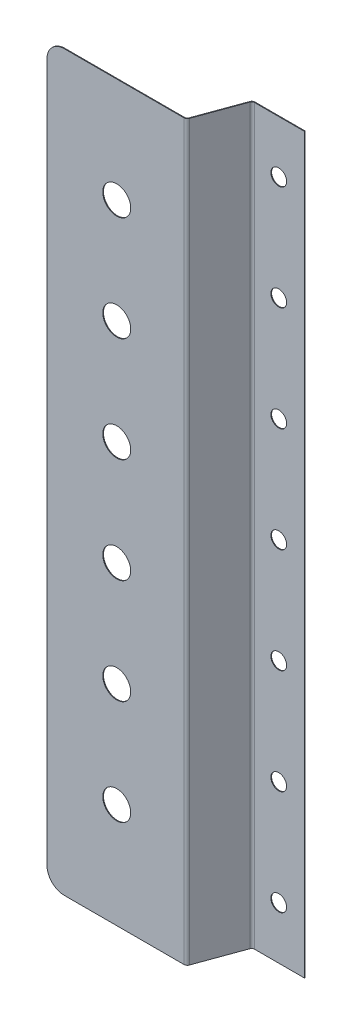
ISO-10303-21;
HEADER;
FILE_DESCRIPTION(('STEP AP214'),'2;1');
FILE_NAME('part.step','',(''),(''),'','','');
FILE_SCHEMA(('AUTOMOTIVE_DESIGN { 1 0 10303 214 1 1 1 1 }'));
ENDSEC;
DATA;
#1=APPLICATION_CONTEXT('core data for automotive mechanical design processes');
#2=APPLICATION_PROTOCOL_DEFINITION('international standard','automotive_design',2000,#1);
#3=PRODUCT_CONTEXT('',#1,'mechanical');
#4=PRODUCT('Part','Part','',(#3));
#5=PRODUCT_RELATED_PRODUCT_CATEGORY('part','',(#4));
#6=PRODUCT_DEFINITION_FORMATION('','',#4);
#7=PRODUCT_DEFINITION_CONTEXT('part definition',#1,'design');
#8=PRODUCT_DEFINITION('design','',#6,#7);
#9=PRODUCT_DEFINITION_SHAPE('','',#8);
#10=(LENGTH_UNIT() NAMED_UNIT(*) SI_UNIT(.MILLI.,.METRE.));
#11=(NAMED_UNIT(*) PLANE_ANGLE_UNIT() SI_UNIT($,.RADIAN.));
#12=(NAMED_UNIT(*) SI_UNIT($,.STERADIAN.) SOLID_ANGLE_UNIT());
#13=UNCERTAINTY_MEASURE_WITH_UNIT(LENGTH_MEASURE(1.E-05),#10,'distance_accuracy_value','');
#14=(GEOMETRIC_REPRESENTATION_CONTEXT(3) GLOBAL_UNCERTAINTY_ASSIGNED_CONTEXT((#13)) GLOBAL_UNIT_ASSIGNED_CONTEXT((#10,
#11,#12)) REPRESENTATION_CONTEXT('',''));
#15=CARTESIAN_POINT('',(0.,0.,0.));
#16=DIRECTION('',(0.,0.,1.));
#17=DIRECTION('',(1.,0.,0.));
#18=AXIS2_PLACEMENT_3D('',#15,#16,#17);
#19=CARTESIAN_POINT('',(45.0575081030319,0.,-14.0953893117886));
#20=DIRECTION('',(0.,1.,0.));
#21=DIRECTION('',(0.,0.,1.));
#22=AXIS2_PLACEMENT_3D('',#19,#20,#21);
#23=PLANE('',#22);
#24=DIRECTION('',(-0.939692620785907,0.,-0.342020143325671));
#25=VECTOR('',#24,1.);
#26=CARTESIAN_POINT('',(44.808309344353,0.,-13.4107213493623));
#27=LINE('',#26,#25);
#28=CARTESIAN_POINT('',(44.808309344353,0.,-13.4107213493623));
#29=VERTEX_POINT('',#28);
#30=CARTESIAN_POINT('',(44.6203708201958,0.,-13.4791253780274));
#31=VERTEX_POINT('',#30);
#32=EDGE_CURVE('E243',#29,#31,#27,.T.);
#33=ORIENTED_EDGE('',*,*,#32,.F.);
#34=DIRECTION('',(0.342020143325673,0.,-0.939692620785907));
#35=VECTOR('',#34,1.);
#36=CARTESIAN_POINT('',(35.2317130710728,0.,12.9007606667079));
#37=LINE('',#36,#35);
#38=CARTESIAN_POINT('',(40.1515076814876,0.,-0.616263933761181));
#39=VERTEX_POINT('',#38);
#40=EDGE_CURVE('E252',#39,#29,#37,.T.);
#41=ORIENTED_EDGE('',*,*,#40,.F.);
#42=DIRECTION('',(-0.939692620785907,0.,-0.342020143325673));
#43=VECTOR('',#42,1.);
#44=CARTESIAN_POINT('',(39.9635691573305,0.,-0.684667962426318));
#45=LINE('',#44,#43);
#46=CARTESIAN_POINT('',(39.9635691573305,0.,-0.684667962426315));
#47=VERTEX_POINT('',#46);
#48=EDGE_CURVE('E263',#47,#39,#45,.F.);
#49=ORIENTED_EDGE('',*,*,#48,.F.);
#50=DIRECTION('',(-0.342020143325673,0.,0.939692620785907));
#51=VECTOR('',#50,1.);
#52=CARTESIAN_POINT('',(44.8695695788747,0.,-14.1637933404537));
#53=LINE('',#52,#51);
#54=EDGE_CURVE('E257',#47,#31,#53,.F.);
#55=ORIENTED_EDGE('',*,*,#54,.T.);
#56=EDGE_LOOP('',(#33,#41,#49,#55));
#57=FACE_BOUND('',#56,.T.);
#58=ADVANCED_FACE('F78',(#57),#23,.F.);
#59=CARTESIAN_POINT('',(39.975102969662,210.,-0.131595971334866));
#60=DIRECTION('',(0.,-1.,0.));
#61=DIRECTION('',(0.,0.,-1.));
#62=AXIS2_PLACEMENT_3D('',#59,#60,#61);
#63=PLANE('',#62);
#64=DIRECTION('',(-0.939692620785907,0.,-0.342020143325671));
#65=VECTOR('',#64,1.);
#66=CARTESIAN_POINT('',(44.808309344353,210.,-13.4107213493623));
#67=LINE('',#66,#65);
#68=CARTESIAN_POINT('',(44.808309344353,210.,-13.4107213493623));
#69=VERTEX_POINT('',#68);
#70=CARTESIAN_POINT('',(44.6203708201958,210.,-13.4791253780274));
#71=VERTEX_POINT('',#70);
#72=EDGE_CURVE('E232',#69,#71,#67,.T.);
#73=ORIENTED_EDGE('',*,*,#72,.T.);
#74=DIRECTION('',(0.342020143325673,0.,-0.939692620785907));
#75=VECTOR('',#74,1.);
#76=CARTESIAN_POINT('',(39.7871644455048,210.,-0.199999999999997));
#77=LINE('',#76,#75);
#78=CARTESIAN_POINT('',(39.9635691573305,210.,-0.684667962426315));
#79=VERTEX_POINT('',#78);
#80=EDGE_CURVE('E255',#71,#79,#77,.F.);
#81=ORIENTED_EDGE('',*,*,#80,.T.);
#82=DIRECTION('',(-0.939692620785907,0.,-0.342020143325673));
#83=VECTOR('',#82,1.);
#84=CARTESIAN_POINT('',(40.1515076814876,210.,-0.616263933761178));
#85=LINE('',#84,#83);
#86=CARTESIAN_POINT('',(40.1515076814876,210.,-0.61626393376118));
#87=VERTEX_POINT('',#86);
#88=EDGE_CURVE('E246',#79,#87,#85,.F.);
#89=ORIENTED_EDGE('',*,*,#88,.T.);
#90=DIRECTION('',(-0.342020143325673,0.,0.939692620785907));
#91=VECTOR('',#90,1.);
#92=CARTESIAN_POINT('',(35.2317130710728,210.,12.9007606667079));
#93=LINE('',#92,#91);
#94=EDGE_CURVE('E249',#69,#87,#93,.T.);
#95=ORIENTED_EDGE('',*,*,#94,.F.);
#96=EDGE_LOOP('',(#73,#81,#89,#95));
#97=FACE_BOUND('',#96,.T.);
#98=ADVANCED_FACE('F399',(#97),#63,.F.);
#99=CARTESIAN_POINT('',(35.2317130710728,0.,12.9007606667079));
#100=DIRECTION('',(-0.939692620785907,0.,-0.342020143325673));
#101=DIRECTION('',(-0.342020143325673,0.,0.939692620785907));
#102=AXIS2_PLACEMENT_3D('',#99,#100,#101);
#103=PLANE('',#102);
#104=DIRECTION('',(0.,1.,0.));
#105=VECTOR('',#104,1.);
#106=CARTESIAN_POINT('',(44.808309344353,210.,-13.4107213493623));
#107=LINE('',#106,#105);
#108=EDGE_CURVE('E238',#69,#29,#107,.F.);
#109=ORIENTED_EDGE('',*,*,#108,.F.);
#110=ORIENTED_EDGE('',*,*,#94,.T.);
#111=DIRECTION('',(0.,-1.,0.));
#112=VECTOR('',#111,1.);
#113=CARTESIAN_POINT('',(40.1515076814876,210.,-0.616263933761174));
#114=LINE('',#113,#112);
#115=EDGE_CURVE('E260',#39,#87,#114,.F.);
#116=ORIENTED_EDGE('',*,*,#115,.F.);
#117=ORIENTED_EDGE('',*,*,#40,.T.);
#118=EDGE_LOOP('',(#109,#110,#116,#117));
#119=FACE_BOUND('',#118,.T.);
#120=ADVANCED_FACE('F382',(#119),#103,.F.);
#121=CARTESIAN_POINT('',(35.0437745469156,0.,12.8323566380428));
#122=DIRECTION('',(-0.939692620785907,0.,-0.342020143325673));
#123=DIRECTION('',(-0.342020143325673,0.,0.939692620785907));
#124=AXIS2_PLACEMENT_3D('',#121,#122,#123);
#125=PLANE('',#124);
#126=ORIENTED_EDGE('',*,*,#80,.F.);
#127=DIRECTION('',(0.,1.,0.));
#128=VECTOR('',#127,1.);
#129=CARTESIAN_POINT('',(44.6203708201958,210.,-13.4791253780274));
#130=LINE('',#129,#128);
#131=EDGE_CURVE('E225',#71,#31,#130,.F.);
#132=ORIENTED_EDGE('',*,*,#131,.T.);
#133=ORIENTED_EDGE('',*,*,#54,.F.);
#134=DIRECTION('',(0.,-1.,0.));
#135=VECTOR('',#134,1.);
#136=CARTESIAN_POINT('',(39.9635691573305,210.,-0.684667962426312));
#137=LINE('',#136,#135);
#138=EDGE_CURVE('E266',#79,#47,#137,.T.);
#139=ORIENTED_EDGE('',*,*,#138,.F.);
#140=EDGE_LOOP('',(#126,#132,#133,#139));
#141=FACE_BOUND('',#140,.T.);
#142=ADVANCED_FACE('F390',(#141),#125,.T.);
#143=CARTESIAN_POINT('',(0.,0.,-0.2));
#144=DIRECTION('',(0.,-1.,0.));
#145=DIRECTION('',(0.,0.,-1.));
#146=AXIS2_PLACEMENT_3D('',#143,#144,#145);
#147=PLANE('',#146);
#148=DIRECTION('',(1.,0.,0.));
#149=VECTOR('',#148,1.);
#150=CARTESIAN_POINT('',(0.,0.,0.));
#151=LINE('',#150,#149);
#152=CARTESIAN_POINT('',(5.,0.,0.));
#153=VERTEX_POINT('',#152);
#154=CARTESIAN_POINT('',(39.2713915728596,0.,0.));
#155=VERTEX_POINT('',#154);
#156=EDGE_CURVE('E340',#153,#155,#151,.T.);
#157=ORIENTED_EDGE('',*,*,#156,.F.);
#158=DIRECTION('',(0.,0.,1.));
#159=VECTOR('',#158,1.);
#160=CARTESIAN_POINT('',(5.,0.,-0.2));
#161=LINE('',#160,#159);
#162=CARTESIAN_POINT('',(5.,0.,-0.2));
#163=VERTEX_POINT('',#162);
#164=EDGE_CURVE('E101',#153,#163,#161,.F.);
#165=ORIENTED_EDGE('',*,*,#164,.T.);
#166=DIRECTION('',(1.,0.,0.));
#167=VECTOR('',#166,1.);
#168=CARTESIAN_POINT('',(0.,0.,-0.2));
#169=LINE('',#168,#167);
#170=CARTESIAN_POINT('',(39.2713915728596,0.,-0.2));
#171=VERTEX_POINT('',#170);
#172=EDGE_CURVE('E332',#163,#171,#169,.T.);
#173=ORIENTED_EDGE('',*,*,#172,.T.);
#174=DIRECTION('',(0.,0.,1.));
#175=VECTOR('',#174,1.);
#176=CARTESIAN_POINT('',(39.2713915728596,0.,-0.200000000000005));
#177=LINE('',#176,#175);
#178=EDGE_CURVE('E276',#171,#155,#177,.T.);
#179=ORIENTED_EDGE('',*,*,#178,.T.);
#180=EDGE_LOOP('',(#157,#165,#173,#179));
#181=FACE_BOUND('',#180,.T.);
#182=ADVANCED_FACE('F365',(#181),#147,.T.);
#183=CARTESIAN_POINT('',(0.,0.,-0.2));
#184=DIRECTION('',(0.,0.,-1.));
#185=DIRECTION('',(-1.,0.,0.));
#186=AXIS2_PLACEMENT_3D('',#183,#184,#185);
#187=PLANE('',#186);
#188=CARTESIAN_POINT('',(20.,30.,-0.2));
#189=DIRECTION('',(0.,0.,1.));
#190=DIRECTION('',(-1.,0.,0.));
#191=AXIS2_PLACEMENT_3D('',#188,#189,#190);
#192=CIRCLE('',#191,4.);
#193=CARTESIAN_POINT('',(16.,30.,-0.2));
#194=VERTEX_POINT('',#193);
#195=EDGE_CURVE('E293',#194,#194,#192,.T.);
#196=ORIENTED_EDGE('',*,*,#195,.T.);
#197=EDGE_LOOP('',(#196));
#198=FACE_BOUND('',#197,.T.);
#199=CARTESIAN_POINT('',(20.,60.,-0.2));
#200=DIRECTION('',(0.,0.,1.));
#201=DIRECTION('',(-1.,0.,0.));
#202=AXIS2_PLACEMENT_3D('',#199,#200,#201);
#203=CIRCLE('',#202,4.);
#204=CARTESIAN_POINT('',(16.,60.,-0.2));
#205=VERTEX_POINT('',#204);
#206=EDGE_CURVE('E299',#205,#205,#203,.T.);
#207=ORIENTED_EDGE('',*,*,#206,.T.);
#208=EDGE_LOOP('',(#207));
#209=FACE_BOUND('',#208,.T.);
#210=CARTESIAN_POINT('',(20.,90.,-0.2));
#211=DIRECTION('',(0.,0.,1.));
#212=DIRECTION('',(-1.,0.,0.));
#213=AXIS2_PLACEMENT_3D('',#210,#211,#212);
#214=CIRCLE('',#213,4.);
#215=CARTESIAN_POINT('',(16.,90.,-0.2));
#216=VERTEX_POINT('',#215);
#217=EDGE_CURVE('E305',#216,#216,#214,.T.);
#218=ORIENTED_EDGE('',*,*,#217,.T.);
#219=EDGE_LOOP('',(#218));
#220=FACE_BOUND('',#219,.T.);
#221=CARTESIAN_POINT('',(20.,180.,-0.2));
#222=DIRECTION('',(0.,0.,1.));
#223=DIRECTION('',(1.,0.,0.));
#224=AXIS2_PLACEMENT_3D('',#221,#222,#223);
#225=CIRCLE('',#224,4.);
#226=CARTESIAN_POINT('',(24.,180.,-0.2));
#227=VERTEX_POINT('',#226);
#228=EDGE_CURVE('E311',#227,#227,#225,.T.);
#229=ORIENTED_EDGE('',*,*,#228,.T.);
#230=EDGE_LOOP('',(#229));
#231=FACE_BOUND('',#230,.T.);
#232=CARTESIAN_POINT('',(20.,150.,-0.2));
#233=DIRECTION('',(0.,0.,1.));
#234=DIRECTION('',(1.,0.,0.));
#235=AXIS2_PLACEMENT_3D('',#232,#233,#234);
#236=CIRCLE('',#235,4.);
#237=CARTESIAN_POINT('',(24.,150.,-0.2));
#238=VERTEX_POINT('',#237);
#239=EDGE_CURVE('E317',#238,#238,#236,.T.);
#240=ORIENTED_EDGE('',*,*,#239,.T.);
#241=EDGE_LOOP('',(#240));
#242=FACE_BOUND('',#241,.T.);
#243=CARTESIAN_POINT('',(20.,120.,-0.2));
#244=DIRECTION('',(0.,0.,1.));
#245=DIRECTION('',(1.,0.,0.));
#246=AXIS2_PLACEMENT_3D('',#243,#244,#245);
#247=CIRCLE('',#246,4.);
#248=CARTESIAN_POINT('',(24.,120.,-0.2));
#249=VERTEX_POINT('',#248);
#250=EDGE_CURVE('E323',#249,#249,#247,.T.);
#251=ORIENTED_EDGE('',*,*,#250,.T.);
#252=EDGE_LOOP('',(#251));
#253=FACE_BOUND('',#252,.T.);
#254=ORIENTED_EDGE('',*,*,#172,.F.);
#255=CARTESIAN_POINT('',(5.,5.,-0.2));
#256=DIRECTION('',(0.,0.,-1.));
#257=DIRECTION('',(-1.,0.,0.));
#258=AXIS2_PLACEMENT_3D('',#255,#256,#257);
#259=CIRCLE('',#258,5.);
#260=CARTESIAN_POINT('',(0.,5.,-0.2));
#261=VERTEX_POINT('',#260);
#262=EDGE_CURVE('E86',#163,#261,#259,.T.);
#263=ORIENTED_EDGE('',*,*,#262,.T.);
#264=DIRECTION('',(0.,-1.,0.));
#265=VECTOR('',#264,1.);
#266=CARTESIAN_POINT('',(0.,0.,-0.2));
#267=LINE('',#266,#265);
#268=CARTESIAN_POINT('',(0.,205.,-0.2));
#269=VERTEX_POINT('',#268);
#270=EDGE_CURVE('E329',#269,#261,#267,.T.);
#271=ORIENTED_EDGE('',*,*,#270,.F.);
#272=CARTESIAN_POINT('',(5.,205.,-0.2));
#273=DIRECTION('',(0.,0.,-1.));
#274=DIRECTION('',(-1.,0.,0.));
#275=AXIS2_PLACEMENT_3D('',#272,#273,#274);
#276=CIRCLE('',#275,5.);
#277=CARTESIAN_POINT('',(5.,210.,-0.2));
#278=VERTEX_POINT('',#277);
#279=EDGE_CURVE('E93',#269,#278,#276,.T.);
#280=ORIENTED_EDGE('',*,*,#279,.T.);
#281=DIRECTION('',(-1.,0.,0.));
#282=VECTOR('',#281,1.);
#283=CARTESIAN_POINT('',(0.,210.,-0.2));
#284=LINE('',#283,#282);
#285=CARTESIAN_POINT('',(39.2713915728596,210.,-0.2));
#286=VERTEX_POINT('',#285);
#287=EDGE_CURVE('E335',#286,#278,#284,.T.);
#288=ORIENTED_EDGE('',*,*,#287,.F.);
#289=DIRECTION('',(0.,-1.,0.));
#290=VECTOR('',#289,1.);
#291=CARTESIAN_POINT('',(39.2713915728596,0.,-0.200000000000005));
#292=LINE('',#291,#290);
#293=EDGE_CURVE('E282',#171,#286,#292,.F.);
#294=ORIENTED_EDGE('',*,*,#293,.F.);
#295=EDGE_LOOP('',(#254,#263,#271,#280,#288,#294));
#296=FACE_BOUND('',#295,.T.);
#297=ADVANCED_FACE('F354',(#198,#209,#220,#231,#242,#253,#296),#187,.T.);
#298=CARTESIAN_POINT('',(0.,0.,0.));
#299=DIRECTION('',(0.,0.,-1.));
#300=DIRECTION('',(-1.,0.,0.));
#301=AXIS2_PLACEMENT_3D('',#298,#299,#300);
#302=PLANE('',#301);
#303=CARTESIAN_POINT('',(20.,120.,0.));
#304=DIRECTION('',(0.,0.,1.));
#305=DIRECTION('',(1.,0.,0.));
#306=AXIS2_PLACEMENT_3D('',#303,#304,#305);
#307=CIRCLE('',#306,4.);
#308=CARTESIAN_POINT('',(24.,120.,0.));
#309=VERTEX_POINT('',#308);
#310=EDGE_CURVE('E320',#309,#309,#307,.T.);
#311=ORIENTED_EDGE('',*,*,#310,.F.);
#312=EDGE_LOOP('',(#311));
#313=FACE_BOUND('',#312,.T.);
#314=CARTESIAN_POINT('',(20.,150.,0.));
#315=DIRECTION('',(0.,0.,1.));
#316=DIRECTION('',(1.,0.,0.));
#317=AXIS2_PLACEMENT_3D('',#314,#315,#316);
#318=CIRCLE('',#317,4.);
#319=CARTESIAN_POINT('',(24.,150.,0.));
#320=VERTEX_POINT('',#319);
#321=EDGE_CURVE('E314',#320,#320,#318,.T.);
#322=ORIENTED_EDGE('',*,*,#321,.F.);
#323=EDGE_LOOP('',(#322));
#324=FACE_BOUND('',#323,.T.);
#325=CARTESIAN_POINT('',(20.,180.,0.));
#326=DIRECTION('',(0.,0.,1.));
#327=DIRECTION('',(1.,0.,0.));
#328=AXIS2_PLACEMENT_3D('',#325,#326,#327);
#329=CIRCLE('',#328,4.);
#330=CARTESIAN_POINT('',(24.,180.,0.));
#331=VERTEX_POINT('',#330);
#332=EDGE_CURVE('E308',#331,#331,#329,.T.);
#333=ORIENTED_EDGE('',*,*,#332,.F.);
#334=EDGE_LOOP('',(#333));
#335=FACE_BOUND('',#334,.T.);
#336=CARTESIAN_POINT('',(20.,90.,0.));
#337=DIRECTION('',(0.,0.,1.));
#338=DIRECTION('',(-1.,0.,0.));
#339=AXIS2_PLACEMENT_3D('',#336,#337,#338);
#340=CIRCLE('',#339,4.);
#341=CARTESIAN_POINT('',(16.,90.,0.));
#342=VERTEX_POINT('',#341);
#343=EDGE_CURVE('E302',#342,#342,#340,.T.);
#344=ORIENTED_EDGE('',*,*,#343,.F.);
#345=EDGE_LOOP('',(#344));
#346=FACE_BOUND('',#345,.T.);
#347=CARTESIAN_POINT('',(20.,60.,0.));
#348=DIRECTION('',(0.,0.,1.));
#349=DIRECTION('',(-1.,0.,0.));
#350=AXIS2_PLACEMENT_3D('',#347,#348,#349);
#351=CIRCLE('',#350,4.);
#352=CARTESIAN_POINT('',(16.,60.,0.));
#353=VERTEX_POINT('',#352);
#354=EDGE_CURVE('E296',#353,#353,#351,.T.);
#355=ORIENTED_EDGE('',*,*,#354,.F.);
#356=EDGE_LOOP('',(#355));
#357=FACE_BOUND('',#356,.T.);
#358=CARTESIAN_POINT('',(20.,30.,0.));
#359=DIRECTION('',(0.,0.,1.));
#360=DIRECTION('',(-1.,0.,0.));
#361=AXIS2_PLACEMENT_3D('',#358,#359,#360);
#362=CIRCLE('',#361,4.);
#363=CARTESIAN_POINT('',(16.,30.,0.));
#364=VERTEX_POINT('',#363);
#365=EDGE_CURVE('E290',#364,#364,#362,.T.);
#366=ORIENTED_EDGE('',*,*,#365,.F.);
#367=EDGE_LOOP('',(#366));
#368=FACE_BOUND('',#367,.T.);
#369=DIRECTION('',(0.,-1.,0.));
#370=VECTOR('',#369,1.);
#371=CARTESIAN_POINT('',(0.,0.,0.));
#372=LINE('',#371,#370);
#373=CARTESIAN_POINT('',(0.,205.,0.));
#374=VERTEX_POINT('',#373);
#375=CARTESIAN_POINT('',(0.,5.,0.));
#376=VERTEX_POINT('',#375);
#377=EDGE_CURVE('E326',#374,#376,#372,.T.);
#378=ORIENTED_EDGE('',*,*,#377,.T.);
#379=CARTESIAN_POINT('',(5.,5.,0.));
#380=DIRECTION('',(0.,0.,-1.));
#381=DIRECTION('',(-1.,0.,0.));
#382=AXIS2_PLACEMENT_3D('',#379,#380,#381);
#383=CIRCLE('',#382,5.);
#384=EDGE_CURVE('E350',#376,#153,#383,.F.);
#385=ORIENTED_EDGE('',*,*,#384,.T.);
#386=ORIENTED_EDGE('',*,*,#156,.T.);
#387=DIRECTION('',(0.,-1.,0.));
#388=VECTOR('',#387,1.);
#389=CARTESIAN_POINT('',(39.2713915728596,0.,0.));
#390=LINE('',#389,#388);
#391=CARTESIAN_POINT('',(39.2713915728596,210.,0.));
#392=VERTEX_POINT('',#391);
#393=EDGE_CURVE('E270',#155,#392,#390,.F.);
#394=ORIENTED_EDGE('',*,*,#393,.T.);
#395=DIRECTION('',(-1.,0.,0.));
#396=VECTOR('',#395,1.);
#397=CARTESIAN_POINT('',(0.,210.,0.));
#398=LINE('',#397,#396);
#399=CARTESIAN_POINT('',(5.,210.,0.));
#400=VERTEX_POINT('',#399);
#401=EDGE_CURVE('E333',#392,#400,#398,.T.);
#402=ORIENTED_EDGE('',*,*,#401,.T.);
#403=CARTESIAN_POINT('',(5.,205.,0.));
#404=DIRECTION('',(0.,0.,-1.));
#405=DIRECTION('',(-1.,0.,0.));
#406=AXIS2_PLACEMENT_3D('',#403,#404,#405);
#407=CIRCLE('',#406,5.);
#408=EDGE_CURVE('E348',#400,#374,#407,.F.);
#409=ORIENTED_EDGE('',*,*,#408,.T.);
#410=EDGE_LOOP('',(#378,#385,#386,#394,#402,#409));
#411=FACE_BOUND('',#410,.T.);
#412=ADVANCED_FACE('F364',(#313,#324,#335,#346,#357,#368,#411),#302,.F.);
#413=CARTESIAN_POINT('',(0.,0.,-0.2));
#414=DIRECTION('',(-1.,0.,0.));
#415=DIRECTION('',(0.,0.,1.));
#416=AXIS2_PLACEMENT_3D('',#413,#414,#415);
#417=PLANE('',#416);
#418=ORIENTED_EDGE('',*,*,#270,.T.);
#419=DIRECTION('',(0.,0.,1.));
#420=VECTOR('',#419,1.);
#421=CARTESIAN_POINT('',(0.,5.,-0.2));
#422=LINE('',#421,#420);
#423=EDGE_CURVE('E345',#261,#376,#422,.T.);
#424=ORIENTED_EDGE('',*,*,#423,.T.);
#425=ORIENTED_EDGE('',*,*,#377,.F.);
#426=DIRECTION('',(0.,0.,1.));
#427=VECTOR('',#426,1.);
#428=CARTESIAN_POINT('',(0.,205.,-0.2));
#429=LINE('',#428,#427);
#430=EDGE_CURVE('E337',#374,#269,#429,.F.);
#431=ORIENTED_EDGE('',*,*,#430,.T.);
#432=EDGE_LOOP('',(#418,#424,#425,#431));
#433=FACE_BOUND('',#432,.T.);
#434=ADVANCED_FACE('F359',(#433),#417,.T.);
#435=CARTESIAN_POINT('',(0.,210.,-0.2));
#436=DIRECTION('',(0.,1.,0.));
#437=DIRECTION('',(0.,0.,1.));
#438=AXIS2_PLACEMENT_3D('',#435,#436,#437);
#439=PLANE('',#438);
#440=ORIENTED_EDGE('',*,*,#287,.T.);
#441=DIRECTION('',(0.,0.,1.));
#442=VECTOR('',#441,1.);
#443=CARTESIAN_POINT('',(5.,210.,-0.2));
#444=LINE('',#443,#442);
#445=EDGE_CURVE('E13',#278,#400,#444,.T.);
#446=ORIENTED_EDGE('',*,*,#445,.T.);
#447=ORIENTED_EDGE('',*,*,#401,.F.);
#448=DIRECTION('',(0.,0.,1.));
#449=VECTOR('',#448,1.);
#450=CARTESIAN_POINT('',(39.2713915728596,210.,-0.200000000000005));
#451=LINE('',#450,#449);
#452=EDGE_CURVE('E287',#286,#392,#451,.T.);
#453=ORIENTED_EDGE('',*,*,#452,.F.);
#454=EDGE_LOOP('',(#440,#446,#447,#453));
#455=FACE_BOUND('',#454,.T.);
#456=ADVANCED_FACE('F408',(#455),#439,.T.);
#457=CARTESIAN_POINT('',(20.,120.,-0.2));
#458=DIRECTION('',(0.,0.,1.));
#459=DIRECTION('',(1.,0.,0.));
#460=AXIS2_PLACEMENT_3D('',#457,#458,#459);
#461=CYLINDRICAL_SURFACE('',#460,4.);
#462=ORIENTED_EDGE('',*,*,#250,.F.);
#463=EDGE_LOOP('',(#462));
#464=FACE_BOUND('',#463,.T.);
#465=ORIENTED_EDGE('',*,*,#310,.T.);
#466=EDGE_LOOP('',(#465));
#467=FACE_BOUND('',#466,.T.);
#468=ADVANCED_FACE('F450',(#464,#467),#461,.F.);
#469=CARTESIAN_POINT('',(20.,150.,-0.2));
#470=DIRECTION('',(0.,0.,1.));
#471=DIRECTION('',(1.,0.,0.));
#472=AXIS2_PLACEMENT_3D('',#469,#470,#471);
#473=CYLINDRICAL_SURFACE('',#472,4.);
#474=ORIENTED_EDGE('',*,*,#239,.F.);
#475=EDGE_LOOP('',(#474));
#476=FACE_BOUND('',#475,.T.);
#477=ORIENTED_EDGE('',*,*,#321,.T.);
#478=EDGE_LOOP('',(#477));
#479=FACE_BOUND('',#478,.T.);
#480=ADVANCED_FACE('F446',(#476,#479),#473,.F.);
#481=CARTESIAN_POINT('',(20.,180.,-0.2));
#482=DIRECTION('',(0.,0.,1.));
#483=DIRECTION('',(1.,0.,0.));
#484=AXIS2_PLACEMENT_3D('',#481,#482,#483);
#485=CYLINDRICAL_SURFACE('',#484,4.);
#486=ORIENTED_EDGE('',*,*,#228,.F.);
#487=EDGE_LOOP('',(#486));
#488=FACE_BOUND('',#487,.T.);
#489=ORIENTED_EDGE('',*,*,#332,.T.);
#490=EDGE_LOOP('',(#489));
#491=FACE_BOUND('',#490,.T.);
#492=ADVANCED_FACE('F442',(#488,#491),#485,.F.);
#493=CARTESIAN_POINT('',(20.,90.,-0.2));
#494=DIRECTION('',(0.,0.,1.));
#495=DIRECTION('',(1.,0.,0.));
#496=AXIS2_PLACEMENT_3D('',#493,#494,#495);
#497=CYLINDRICAL_SURFACE('',#496,4.);
#498=ORIENTED_EDGE('',*,*,#217,.F.);
#499=EDGE_LOOP('',(#498));
#500=FACE_BOUND('',#499,.T.);
#501=ORIENTED_EDGE('',*,*,#343,.T.);
#502=EDGE_LOOP('',(#501));
#503=FACE_BOUND('',#502,.T.);
#504=ADVANCED_FACE('F438',(#500,#503),#497,.F.);
#505=CARTESIAN_POINT('',(20.,60.,-0.2));
#506=DIRECTION('',(0.,0.,1.));
#507=DIRECTION('',(1.,0.,0.));
#508=AXIS2_PLACEMENT_3D('',#505,#506,#507);
#509=CYLINDRICAL_SURFACE('',#508,4.);
#510=ORIENTED_EDGE('',*,*,#206,.F.);
#511=EDGE_LOOP('',(#510));
#512=FACE_BOUND('',#511,.T.);
#513=ORIENTED_EDGE('',*,*,#354,.T.);
#514=EDGE_LOOP('',(#513));
#515=FACE_BOUND('',#514,.T.);
#516=ADVANCED_FACE('F434',(#512,#515),#509,.F.);
#517=CARTESIAN_POINT('',(20.,30.,-0.2));
#518=DIRECTION('',(0.,0.,1.));
#519=DIRECTION('',(1.,0.,0.));
#520=AXIS2_PLACEMENT_3D('',#517,#518,#519);
#521=CYLINDRICAL_SURFACE('',#520,4.);
#522=ORIENTED_EDGE('',*,*,#195,.F.);
#523=EDGE_LOOP('',(#522));
#524=FACE_BOUND('',#523,.T.);
#525=ORIENTED_EDGE('',*,*,#365,.T.);
#526=EDGE_LOOP('',(#525));
#527=FACE_BOUND('',#526,.T.);
#528=ADVANCED_FACE('F429',(#524,#527),#521,.F.);
#529=CARTESIAN_POINT('',(39.2713915728596,210.,-0.936600000000005));
#530=DIRECTION('',(0.,1.,0.));
#531=DIRECTION('',(0.,0.,1.));
#532=AXIS2_PLACEMENT_3D('',#529,#530,#531);
#533=PLANE('',#532);
#534=ORIENTED_EDGE('',*,*,#88,.F.);
#535=CARTESIAN_POINT('',(39.2713915728596,210.,-0.936600000000005));
#536=DIRECTION('',(0.,-1.,0.));
#537=DIRECTION('',(0.,0.,-1.));
#538=AXIS2_PLACEMENT_3D('',#535,#536,#537);
#539=CIRCLE('',#538,0.7366);
#540=EDGE_CURVE('E279',#286,#79,#539,.F.);
#541=ORIENTED_EDGE('',*,*,#540,.F.);
#542=ORIENTED_EDGE('',*,*,#452,.T.);
#543=CARTESIAN_POINT('',(39.2713915728596,210.,-0.936600000000005));
#544=DIRECTION('',(0.,-1.,0.));
#545=DIRECTION('',(0.,0.,-1.));
#546=AXIS2_PLACEMENT_3D('',#543,#544,#545);
#547=CIRCLE('',#546,0.9366);
#548=EDGE_CURVE('E272',#392,#87,#547,.F.);
#549=ORIENTED_EDGE('',*,*,#548,.T.);
#550=EDGE_LOOP('',(#534,#541,#542,#549));
#551=FACE_BOUND('',#550,.T.);
#552=ADVANCED_FACE('F403',(#551),#533,.T.);
#553=CARTESIAN_POINT('',(39.2713915728596,0.,-0.936600000000005));
#554=DIRECTION('',(0.,1.,0.));
#555=DIRECTION('',(0.,0.,1.));
#556=AXIS2_PLACEMENT_3D('',#553,#554,#555);
#557=PLANE('',#556);
#558=CARTESIAN_POINT('',(39.2713915728596,0.,-0.936600000000005));
#559=DIRECTION('',(0.,-1.,0.));
#560=DIRECTION('',(0.,0.,-1.));
#561=AXIS2_PLACEMENT_3D('',#558,#559,#560);
#562=CIRCLE('',#561,0.7366);
#563=EDGE_CURVE('E251',#47,#171,#562,.T.);
#564=ORIENTED_EDGE('',*,*,#563,.F.);
#565=ORIENTED_EDGE('',*,*,#48,.T.);
#566=CARTESIAN_POINT('',(39.2713915728596,0.,-0.936600000000005));
#567=DIRECTION('',(0.,-1.,0.));
#568=DIRECTION('',(0.,0.,-1.));
#569=AXIS2_PLACEMENT_3D('',#566,#567,#568);
#570=CIRCLE('',#569,0.9366);
#571=EDGE_CURVE('E273',#39,#155,#570,.T.);
#572=ORIENTED_EDGE('',*,*,#571,.T.);
#573=ORIENTED_EDGE('',*,*,#178,.F.);
#574=EDGE_LOOP('',(#564,#565,#572,#573));
#575=FACE_BOUND('',#574,.T.);
#576=ADVANCED_FACE('F374',(#575),#557,.F.);
#577=CARTESIAN_POINT('',(39.2713915728596,0.,-0.936600000000005));
#578=DIRECTION('',(0.,-1.,0.));
#579=DIRECTION('',(0.939692620785907,0.,0.342020143325673));
#580=AXIS2_PLACEMENT_3D('',#577,#578,#579);
#581=CYLINDRICAL_SURFACE('',#580,0.9366);
#582=ORIENTED_EDGE('',*,*,#393,.F.);
#583=ORIENTED_EDGE('',*,*,#571,.F.);
#584=ORIENTED_EDGE('',*,*,#115,.T.);
#585=ORIENTED_EDGE('',*,*,#548,.F.);
#586=EDGE_LOOP('',(#582,#583,#584,#585));
#587=FACE_BOUND('',#586,.T.);
#588=ADVANCED_FACE('F372',(#587),#581,.T.);
#589=CARTESIAN_POINT('',(39.2713915728596,0.,-0.936600000000005));
#590=DIRECTION('',(0.,-1.,0.));
#591=DIRECTION('',(0.939692620785907,0.,0.342020143325673));
#592=AXIS2_PLACEMENT_3D('',#589,#590,#591);
#593=CYLINDRICAL_SURFACE('',#592,0.7366);
#594=ORIENTED_EDGE('',*,*,#293,.T.);
#595=ORIENTED_EDGE('',*,*,#540,.T.);
#596=ORIENTED_EDGE('',*,*,#138,.T.);
#597=ORIENTED_EDGE('',*,*,#563,.T.);
#598=EDGE_LOOP('',(#594,#595,#596,#597));
#599=FACE_BOUND('',#598,.T.);
#600=ADVANCED_FACE('F405',(#599),#593,.F.);
#601=CARTESIAN_POINT('',(45.5004869288239,0.,-13.1587893117886));
#602=DIRECTION('',(0.,-1.,0.));
#603=DIRECTION('',(0.,0.,-1.));
#604=AXIS2_PLACEMENT_3D('',#601,#602,#603);
#605=PLANE('',#604);
#606=DIRECTION('',(0.,0.,1.));
#607=VECTOR('',#606,1.);
#608=CARTESIAN_POINT('',(45.5004869288239,0.,-14.0953893117886));
#609=LINE('',#608,#607);
#610=CARTESIAN_POINT('',(45.5004869288239,0.,-13.8953893117886));
#611=VERTEX_POINT('',#610);
#612=CARTESIAN_POINT('',(45.5004869288239,0.,-14.0953893117886));
#613=VERTEX_POINT('',#612);
#614=EDGE_CURVE('E206',#611,#613,#609,.F.);
#615=ORIENTED_EDGE('',*,*,#614,.F.);
#616=CARTESIAN_POINT('',(45.5004869288239,0.,-13.1587893117886));
#617=DIRECTION('',(0.,1.,0.));
#618=DIRECTION('',(0.,0.,1.));
#619=AXIS2_PLACEMENT_3D('',#616,#617,#618);
#620=CIRCLE('',#619,0.736599999999997);
#621=EDGE_CURVE('E235',#29,#611,#620,.F.);
#622=ORIENTED_EDGE('',*,*,#621,.F.);
#623=ORIENTED_EDGE('',*,*,#32,.T.);
#624=CARTESIAN_POINT('',(45.5004869288239,0.,-13.1587893117886));
#625=DIRECTION('',(0.,1.,0.));
#626=DIRECTION('',(0.,0.,1.));
#627=AXIS2_PLACEMENT_3D('',#624,#625,#626);
#628=CIRCLE('',#627,0.936599999999997);
#629=EDGE_CURVE('E228',#31,#613,#628,.F.);
#630=ORIENTED_EDGE('',*,*,#629,.T.);
#631=EDGE_LOOP('',(#615,#622,#623,#630));
#632=FACE_BOUND('',#631,.T.);
#633=ADVANCED_FACE('F387',(#632),#605,.T.);
#634=CARTESIAN_POINT('',(45.5004869288239,210.,-13.1587893117886));
#635=DIRECTION('',(0.,-1.,0.));
#636=DIRECTION('',(0.,0.,-1.));
#637=AXIS2_PLACEMENT_3D('',#634,#635,#636);
#638=PLANE('',#637);
#639=CARTESIAN_POINT('',(45.5004869288239,210.,-13.1587893117886));
#640=DIRECTION('',(0.,1.,0.));
#641=DIRECTION('',(0.,0.,1.));
#642=AXIS2_PLACEMENT_3D('',#639,#640,#641);
#643=CIRCLE('',#642,0.736599999999997);
#644=CARTESIAN_POINT('',(45.5004869288239,210.,-13.8953893117886));
#645=VERTEX_POINT('',#644);
#646=EDGE_CURVE('E240',#645,#69,#643,.T.);
#647=ORIENTED_EDGE('',*,*,#646,.F.);
#648=DIRECTION('',(0.,0.,1.));
#649=VECTOR('',#648,1.);
#650=CARTESIAN_POINT('',(45.5004869288239,210.,-13.8953893117886));
#651=LINE('',#650,#649);
#652=CARTESIAN_POINT('',(45.5004869288239,210.,-14.0953893117886));
#653=VERTEX_POINT('',#652);
#654=EDGE_CURVE('E218',#645,#653,#651,.F.);
#655=ORIENTED_EDGE('',*,*,#654,.T.);
#656=CARTESIAN_POINT('',(45.5004869288239,210.,-13.1587893117886));
#657=DIRECTION('',(0.,1.,0.));
#658=DIRECTION('',(0.,0.,1.));
#659=AXIS2_PLACEMENT_3D('',#656,#657,#658);
#660=CIRCLE('',#659,0.936599999999997);
#661=EDGE_CURVE('E229',#653,#71,#660,.T.);
#662=ORIENTED_EDGE('',*,*,#661,.T.);
#663=ORIENTED_EDGE('',*,*,#72,.F.);
#664=EDGE_LOOP('',(#647,#655,#662,#663));
#665=FACE_BOUND('',#664,.T.);
#666=ADVANCED_FACE('F396',(#665),#638,.F.);
#667=CARTESIAN_POINT('',(45.5004869288239,210.,-13.1587893117886));
#668=DIRECTION('',(0.,1.,0.));
#669=DIRECTION('',(0.,0.,-1.));
#670=AXIS2_PLACEMENT_3D('',#667,#668,#669);
#671=CYLINDRICAL_SURFACE('',#670,0.936599999999997);
#672=ORIENTED_EDGE('',*,*,#131,.F.);
#673=ORIENTED_EDGE('',*,*,#661,.F.);
#674=DIRECTION('',(0.,1.,0.));
#675=VECTOR('',#674,1.);
#676=CARTESIAN_POINT('',(45.5004869288239,0.,-14.0953893117886));
#677=LINE('',#676,#675);
#678=EDGE_CURVE('E216',#653,#613,#677,.F.);
#679=ORIENTED_EDGE('',*,*,#678,.T.);
#680=ORIENTED_EDGE('',*,*,#629,.F.);
#681=EDGE_LOOP('',(#672,#673,#679,#680));
#682=FACE_BOUND('',#681,.T.);
#683=ADVANCED_FACE('F393',(#682),#671,.T.);
#684=CARTESIAN_POINT('',(45.5004869288239,210.,-13.1587893117886));
#685=DIRECTION('',(0.,1.,0.));
#686=DIRECTION('',(0.,0.,-1.));
#687=AXIS2_PLACEMENT_3D('',#684,#685,#686);
#688=CYLINDRICAL_SURFACE('',#687,0.736599999999997);
#689=ORIENTED_EDGE('',*,*,#108,.T.);
#690=ORIENTED_EDGE('',*,*,#621,.T.);
#691=DIRECTION('',(0.,1.,0.));
#692=VECTOR('',#691,1.);
#693=CARTESIAN_POINT('',(45.5004869288239,0.,-13.8953893117886));
#694=LINE('',#693,#692);
#695=EDGE_CURVE('E221',#611,#645,#694,.T.);
#696=ORIENTED_EDGE('',*,*,#695,.T.);
#697=ORIENTED_EDGE('',*,*,#646,.T.);
#698=EDGE_LOOP('',(#689,#690,#696,#697));
#699=FACE_BOUND('',#698,.T.);
#700=ADVANCED_FACE('F534',(#699),#688,.F.);
#701=CARTESIAN_POINT('',(59.8446725485367,210.,-14.0953893117886));
#702=DIRECTION('',(0.,-1.,0.));
#703=DIRECTION('',(0.,0.,-1.));
#704=AXIS2_PLACEMENT_3D('',#701,#702,#703);
#705=PLANE('',#704);
#706=ORIENTED_EDGE('',*,*,#654,.F.);
#707=DIRECTION('',(-1.,0.,0.));
#708=VECTOR('',#707,1.);
#709=CARTESIAN_POINT('',(59.8446725485367,210.,-13.8953893117886));
#710=LINE('',#709,#708);
#711=CARTESIAN_POINT('',(59.8446725485367,210.,-13.8953893117886));
#712=VERTEX_POINT('',#711);
#713=EDGE_CURVE('E214',#645,#712,#710,.F.);
#714=ORIENTED_EDGE('',*,*,#713,.T.);
#715=DIRECTION('',(0.,0.,1.));
#716=VECTOR('',#715,1.);
#717=CARTESIAN_POINT('',(59.8446725485367,210.,-14.0953893117886));
#718=LINE('',#717,#716);
#719=CARTESIAN_POINT('',(59.8446725485367,210.,-14.0953893117886));
#720=VERTEX_POINT('',#719);
#721=EDGE_CURVE('E202',#720,#712,#718,.T.);
#722=ORIENTED_EDGE('',*,*,#721,.F.);
#723=DIRECTION('',(1.,0.,0.));
#724=VECTOR('',#723,1.);
#725=CARTESIAN_POINT('',(-0.0727940468532431,210.,-14.0953893117886));
#726=LINE('',#725,#724);
#727=EDGE_CURVE('E189',#653,#720,#726,.T.);
#728=ORIENTED_EDGE('',*,*,#727,.F.);
#729=EDGE_LOOP('',(#706,#714,#722,#728));
#730=FACE_BOUND('',#729,.T.);
#731=ADVANCED_FACE('F541',(#730),#705,.F.);
#732=CARTESIAN_POINT('',(44.9847140561786,0.,-14.0953893117886));
#733=DIRECTION('',(0.,1.,0.));
#734=DIRECTION('',(-1.,0.,0.));
#735=AXIS2_PLACEMENT_3D('',#732,#733,#734);
#736=PLANE('',#735);
#737=ORIENTED_EDGE('',*,*,#614,.T.);
#738=DIRECTION('',(-1.,0.,0.));
#739=VECTOR('',#738,1.);
#740=CARTESIAN_POINT('',(-0.0727940468532431,0.,-14.0953893117886));
#741=LINE('',#740,#739);
#742=CARTESIAN_POINT('',(59.8446725485367,0.,-14.0953893117886));
#743=VERTEX_POINT('',#742);
#744=EDGE_CURVE('E187',#743,#613,#741,.T.);
#745=ORIENTED_EDGE('',*,*,#744,.F.);
#746=DIRECTION('',(0.,0.,1.));
#747=VECTOR('',#746,1.);
#748=CARTESIAN_POINT('',(59.8446725485367,0.,-14.0953893117886));
#749=LINE('',#748,#747);
#750=CARTESIAN_POINT('',(59.8446725485367,0.,-13.8953893117886));
#751=VERTEX_POINT('',#750);
#752=EDGE_CURVE('E195',#743,#751,#749,.T.);
#753=ORIENTED_EDGE('',*,*,#752,.T.);
#754=DIRECTION('',(1.,0.,0.));
#755=VECTOR('',#754,1.);
#756=CARTESIAN_POINT('',(44.9847140561786,0.,-13.8953893117886));
#757=LINE('',#756,#755);
#758=EDGE_CURVE('E211',#751,#611,#757,.F.);
#759=ORIENTED_EDGE('',*,*,#758,.T.);
#760=EDGE_LOOP('',(#737,#745,#753,#759));
#761=FACE_BOUND('',#760,.T.);
#762=ADVANCED_FACE('F205',(#761),#736,.F.);
#763=CARTESIAN_POINT('',(-0.0727940468532431,0.,-14.0953893117886));
#764=DIRECTION('',(0.,0.,1.));
#765=DIRECTION('',(1.,0.,0.));
#766=AXIS2_PLACEMENT_3D('',#763,#764,#765);
#767=PLANE('',#766);
#768=CARTESIAN_POINT('',(52.500708234173,195.,-14.0953893117886));
#769=DIRECTION('',(0.,0.,1.));
#770=DIRECTION('',(1.,0.,0.));
#771=AXIS2_PLACEMENT_3D('',#768,#769,#770);
#772=CIRCLE('',#771,2.25);
#773=CARTESIAN_POINT('',(54.750708234173,195.,-14.0953893117886));
#774=VERTEX_POINT('',#773);
#775=EDGE_CURVE('E224',#774,#774,#772,.T.);
#776=ORIENTED_EDGE('',*,*,#775,.T.);
#777=EDGE_LOOP('',(#776));
#778=FACE_BOUND('',#777,.T.);
#779=CARTESIAN_POINT('',(52.5007082341733,165.,-14.0953893117886));
#780=DIRECTION('',(0.,0.,1.));
#781=DIRECTION('',(1.,0.,0.));
#782=AXIS2_PLACEMENT_3D('',#779,#780,#781);
#783=CIRCLE('',#782,2.25);
#784=CARTESIAN_POINT('',(54.7507082341733,165.,-14.0953893117886));
#785=VERTEX_POINT('',#784);
#786=EDGE_CURVE('E815',#785,#785,#783,.T.);
#787=ORIENTED_EDGE('',*,*,#786,.T.);
#788=EDGE_LOOP('',(#787));
#789=FACE_BOUND('',#788,.T.);
#790=CARTESIAN_POINT('',(52.5007082341736,135.,-14.0953893117886));
#791=DIRECTION('',(0.,0.,1.));
#792=DIRECTION('',(1.,0.,0.));
#793=AXIS2_PLACEMENT_3D('',#790,#791,#792);
#794=CIRCLE('',#793,2.25);
#795=CARTESIAN_POINT('',(54.7507082341736,135.,-14.0953893117886));
#796=VERTEX_POINT('',#795);
#797=EDGE_CURVE('E824',#796,#796,#794,.T.);
#798=ORIENTED_EDGE('',*,*,#797,.T.);
#799=EDGE_LOOP('',(#798));
#800=FACE_BOUND('',#799,.T.);
#801=CARTESIAN_POINT('',(52.5007082341739,105.,-14.0953893117886));
#802=DIRECTION('',(0.,0.,1.));
#803=DIRECTION('',(1.,0.,0.));
#804=AXIS2_PLACEMENT_3D('',#801,#802,#803);
#805=CIRCLE('',#804,2.25);
#806=CARTESIAN_POINT('',(54.7507082341739,105.,-14.0953893117886));
#807=VERTEX_POINT('',#806);
#808=EDGE_CURVE('E830',#807,#807,#805,.T.);
#809=ORIENTED_EDGE('',*,*,#808,.T.);
#810=EDGE_LOOP('',(#809));
#811=FACE_BOUND('',#810,.T.);
#812=CARTESIAN_POINT('',(52.5007082341742,75.,-14.0953893117886));
#813=DIRECTION('',(0.,0.,1.));
#814=DIRECTION('',(1.,0.,0.));
#815=AXIS2_PLACEMENT_3D('',#812,#813,#814);
#816=CIRCLE('',#815,2.25);
#817=CARTESIAN_POINT('',(54.7507082341743,75.,-14.0953893117886));
#818=VERTEX_POINT('',#817);
#819=EDGE_CURVE('E836',#818,#818,#816,.T.);
#820=ORIENTED_EDGE('',*,*,#819,.T.);
#821=EDGE_LOOP('',(#820));
#822=FACE_BOUND('',#821,.T.);
#823=CARTESIAN_POINT('',(52.5007082341746,45.,-14.0953893117886));
#824=DIRECTION('',(0.,0.,1.));
#825=DIRECTION('',(1.,0.,0.));
#826=AXIS2_PLACEMENT_3D('',#823,#824,#825);
#827=CIRCLE('',#826,2.25);
#828=CARTESIAN_POINT('',(54.7507082341746,45.,-14.0953893117886));
#829=VERTEX_POINT('',#828);
#830=EDGE_CURVE('E842',#829,#829,#827,.T.);
#831=ORIENTED_EDGE('',*,*,#830,.T.);
#832=EDGE_LOOP('',(#831));
#833=FACE_BOUND('',#832,.T.);
#834=CARTESIAN_POINT('',(52.5007082341749,15.,-14.0953893117886));
#835=DIRECTION('',(0.,0.,1.));
#836=DIRECTION('',(1.,0.,0.));
#837=AXIS2_PLACEMENT_3D('',#834,#835,#836);
#838=CIRCLE('',#837,2.25);
#839=CARTESIAN_POINT('',(54.7507082341749,15.,-14.0953893117886));
#840=VERTEX_POINT('',#839);
#841=EDGE_CURVE('E848',#840,#840,#838,.T.);
#842=ORIENTED_EDGE('',*,*,#841,.T.);
#843=EDGE_LOOP('',(#842));
#844=FACE_BOUND('',#843,.T.);
#845=ORIENTED_EDGE('',*,*,#678,.F.);
#846=ORIENTED_EDGE('',*,*,#727,.T.);
#847=DIRECTION('',(0.,-1.,0.));
#848=VECTOR('',#847,1.);
#849=CARTESIAN_POINT('',(59.8446725485367,0.,-14.0953893117886));
#850=LINE('',#849,#848);
#851=EDGE_CURVE('E182',#720,#743,#850,.T.);
#852=ORIENTED_EDGE('',*,*,#851,.T.);
#853=ORIENTED_EDGE('',*,*,#744,.T.);
#854=EDGE_LOOP('',(#845,#846,#852,#853));
#855=FACE_BOUND('',#854,.T.);
#856=ADVANCED_FACE('F185',(#778,#789,#800,#811,#822,#833,#844,#855),#767,.F.);
#857=CARTESIAN_POINT('',(-0.0727940468532431,0.,-13.8953893117886));
#858=DIRECTION('',(0.,0.,1.));
#859=DIRECTION('',(1.,0.,0.));
#860=AXIS2_PLACEMENT_3D('',#857,#858,#859);
#861=PLANE('',#860);
#862=CARTESIAN_POINT('',(52.500708234173,195.,-13.8953893117886));
#863=DIRECTION('',(0.,0.,1.));
#864=DIRECTION('',(1.,0.,0.));
#865=AXIS2_PLACEMENT_3D('',#862,#863,#864);
#866=CIRCLE('',#865,2.25);
#867=CARTESIAN_POINT('',(54.750708234173,195.,-13.8953893117886));
#868=VERTEX_POINT('',#867);
#869=EDGE_CURVE('E814',#868,#868,#866,.T.);
#870=ORIENTED_EDGE('',*,*,#869,.F.);
#871=EDGE_LOOP('',(#870));
#872=FACE_BOUND('',#871,.T.);
#873=CARTESIAN_POINT('',(52.5007082341733,165.,-13.8953893117886));
#874=DIRECTION('',(0.,0.,1.));
#875=DIRECTION('',(1.,0.,0.));
#876=AXIS2_PLACEMENT_3D('',#873,#874,#875);
#877=CIRCLE('',#876,2.25);
#878=CARTESIAN_POINT('',(54.7507082341733,165.,-13.8953893117886));
#879=VERTEX_POINT('',#878);
#880=EDGE_CURVE('E819',#879,#879,#877,.T.);
#881=ORIENTED_EDGE('',*,*,#880,.F.);
#882=EDGE_LOOP('',(#881));
#883=FACE_BOUND('',#882,.T.);
#884=CARTESIAN_POINT('',(52.5007082341736,135.,-13.8953893117886));
#885=DIRECTION('',(0.,0.,1.));
#886=DIRECTION('',(1.,0.,0.));
#887=AXIS2_PLACEMENT_3D('',#884,#885,#886);
#888=CIRCLE('',#887,2.25);
#889=CARTESIAN_POINT('',(54.7507082341736,135.,-13.8953893117886));
#890=VERTEX_POINT('',#889);
#891=EDGE_CURVE('E827',#890,#890,#888,.T.);
#892=ORIENTED_EDGE('',*,*,#891,.F.);
#893=EDGE_LOOP('',(#892));
#894=FACE_BOUND('',#893,.T.);
#895=CARTESIAN_POINT('',(52.5007082341739,105.,-13.8953893117886));
#896=DIRECTION('',(0.,0.,1.));
#897=DIRECTION('',(1.,0.,0.));
#898=AXIS2_PLACEMENT_3D('',#895,#896,#897);
#899=CIRCLE('',#898,2.25);
#900=CARTESIAN_POINT('',(54.7507082341739,105.,-13.8953893117886));
#901=VERTEX_POINT('',#900);
#902=EDGE_CURVE('E833',#901,#901,#899,.T.);
#903=ORIENTED_EDGE('',*,*,#902,.F.);
#904=EDGE_LOOP('',(#903));
#905=FACE_BOUND('',#904,.T.);
#906=CARTESIAN_POINT('',(52.5007082341742,75.,-13.8953893117886));
#907=DIRECTION('',(0.,0.,1.));
#908=DIRECTION('',(1.,0.,0.));
#909=AXIS2_PLACEMENT_3D('',#906,#907,#908);
#910=CIRCLE('',#909,2.25);
#911=CARTESIAN_POINT('',(54.7507082341743,75.,-13.8953893117886));
#912=VERTEX_POINT('',#911);
#913=EDGE_CURVE('E839',#912,#912,#910,.T.);
#914=ORIENTED_EDGE('',*,*,#913,.F.);
#915=EDGE_LOOP('',(#914));
#916=FACE_BOUND('',#915,.T.);
#917=CARTESIAN_POINT('',(52.5007082341746,45.,-13.8953893117886));
#918=DIRECTION('',(0.,0.,1.));
#919=DIRECTION('',(1.,0.,0.));
#920=AXIS2_PLACEMENT_3D('',#917,#918,#919);
#921=CIRCLE('',#920,2.25);
#922=CARTESIAN_POINT('',(54.7507082341746,45.,-13.8953893117886));
#923=VERTEX_POINT('',#922);
#924=EDGE_CURVE('E845',#923,#923,#921,.T.);
#925=ORIENTED_EDGE('',*,*,#924,.F.);
#926=EDGE_LOOP('',(#925));
#927=FACE_BOUND('',#926,.T.);
#928=CARTESIAN_POINT('',(52.5007082341749,15.,-13.8953893117886));
#929=DIRECTION('',(0.,0.,1.));
#930=DIRECTION('',(1.,0.,0.));
#931=AXIS2_PLACEMENT_3D('',#928,#929,#930);
#932=CIRCLE('',#931,2.25);
#933=CARTESIAN_POINT('',(54.7507082341749,15.,-13.8953893117886));
#934=VERTEX_POINT('',#933);
#935=EDGE_CURVE('E851',#934,#934,#932,.T.);
#936=ORIENTED_EDGE('',*,*,#935,.F.);
#937=EDGE_LOOP('',(#936));
#938=FACE_BOUND('',#937,.T.);
#939=ORIENTED_EDGE('',*,*,#713,.F.);
#940=ORIENTED_EDGE('',*,*,#695,.F.);
#941=ORIENTED_EDGE('',*,*,#758,.F.);
#942=DIRECTION('',(0.,1.,0.));
#943=VECTOR('',#942,1.);
#944=CARTESIAN_POINT('',(59.8446725485367,0.,-13.8953893117886));
#945=LINE('',#944,#943);
#946=EDGE_CURVE('E198',#712,#751,#945,.F.);
#947=ORIENTED_EDGE('',*,*,#946,.F.);
#948=EDGE_LOOP('',(#939,#940,#941,#947));
#949=FACE_BOUND('',#948,.T.);
#950=ADVANCED_FACE('F563',(#872,#883,#894,#905,#916,#927,#938,#949),#861,.T.);
#951=CARTESIAN_POINT('',(59.8446725485367,0.,-14.0953893117886));
#952=DIRECTION('',(-1.,0.,0.));
#953=DIRECTION('',(0.,0.,1.));
#954=AXIS2_PLACEMENT_3D('',#951,#952,#953);
#955=PLANE('',#954);
#956=ORIENTED_EDGE('',*,*,#946,.T.);
#957=ORIENTED_EDGE('',*,*,#752,.F.);
#958=ORIENTED_EDGE('',*,*,#851,.F.);
#959=ORIENTED_EDGE('',*,*,#721,.T.);
#960=EDGE_LOOP('',(#956,#957,#958,#959));
#961=FACE_BOUND('',#960,.T.);
#962=ADVANCED_FACE('F196',(#961),#955,.F.);
#963=CARTESIAN_POINT('',(52.5007082341749,15.,-14.0953893117886));
#964=DIRECTION('',(0.,0.,1.));
#965=DIRECTION('',(1.,0.,0.));
#966=AXIS2_PLACEMENT_3D('',#963,#964,#965);
#967=CYLINDRICAL_SURFACE('',#966,2.25);
#968=ORIENTED_EDGE('',*,*,#841,.F.);
#969=EDGE_LOOP('',(#968));
#970=FACE_BOUND('',#969,.T.);
#971=ORIENTED_EDGE('',*,*,#935,.T.);
#972=EDGE_LOOP('',(#971));
#973=FACE_BOUND('',#972,.T.);
#974=ADVANCED_FACE('F578',(#970,#973),#967,.F.);
#975=CARTESIAN_POINT('',(52.5007082341746,45.,-14.0953893117886));
#976=DIRECTION('',(0.,0.,1.));
#977=DIRECTION('',(1.,0.,0.));
#978=AXIS2_PLACEMENT_3D('',#975,#976,#977);
#979=CYLINDRICAL_SURFACE('',#978,2.25);
#980=ORIENTED_EDGE('',*,*,#830,.F.);
#981=EDGE_LOOP('',(#980));
#982=FACE_BOUND('',#981,.T.);
#983=ORIENTED_EDGE('',*,*,#924,.T.);
#984=EDGE_LOOP('',(#983));
#985=FACE_BOUND('',#984,.T.);
#986=ADVANCED_FACE('F584',(#982,#985),#979,.F.);
#987=CARTESIAN_POINT('',(52.5007082341742,75.,-14.0953893117886));
#988=DIRECTION('',(0.,0.,1.));
#989=DIRECTION('',(1.,0.,0.));
#990=AXIS2_PLACEMENT_3D('',#987,#988,#989);
#991=CYLINDRICAL_SURFACE('',#990,2.25);
#992=ORIENTED_EDGE('',*,*,#819,.F.);
#993=EDGE_LOOP('',(#992));
#994=FACE_BOUND('',#993,.T.);
#995=ORIENTED_EDGE('',*,*,#913,.T.);
#996=EDGE_LOOP('',(#995));
#997=FACE_BOUND('',#996,.T.);
#998=ADVANCED_FACE('F592',(#994,#997),#991,.F.);
#999=CARTESIAN_POINT('',(52.5007082341739,105.,-14.0953893117886));
#1000=DIRECTION('',(0.,0.,1.));
#1001=DIRECTION('',(1.,0.,0.));
#1002=AXIS2_PLACEMENT_3D('',#999,#1000,#1001);
#1003=CYLINDRICAL_SURFACE('',#1002,2.25);
#1004=ORIENTED_EDGE('',*,*,#808,.F.);
#1005=EDGE_LOOP('',(#1004));
#1006=FACE_BOUND('',#1005,.T.);
#1007=ORIENTED_EDGE('',*,*,#902,.T.);
#1008=EDGE_LOOP('',(#1007));
#1009=FACE_BOUND('',#1008,.T.);
#1010=ADVANCED_FACE('F600',(#1006,#1009),#1003,.F.);
#1011=CARTESIAN_POINT('',(52.5007082341736,135.,-14.0953893117886));
#1012=DIRECTION('',(0.,0.,1.));
#1013=DIRECTION('',(1.,0.,0.));
#1014=AXIS2_PLACEMENT_3D('',#1011,#1012,#1013);
#1015=CYLINDRICAL_SURFACE('',#1014,2.25);
#1016=ORIENTED_EDGE('',*,*,#797,.F.);
#1017=EDGE_LOOP('',(#1016));
#1018=FACE_BOUND('',#1017,.T.);
#1019=ORIENTED_EDGE('',*,*,#891,.T.);
#1020=EDGE_LOOP('',(#1019));
#1021=FACE_BOUND('',#1020,.T.);
#1022=ADVANCED_FACE('F608',(#1018,#1021),#1015,.F.);
#1023=CARTESIAN_POINT('',(52.5007082341733,165.,-14.0953893117886));
#1024=DIRECTION('',(0.,0.,1.));
#1025=DIRECTION('',(1.,0.,0.));
#1026=AXIS2_PLACEMENT_3D('',#1023,#1024,#1025);
#1027=CYLINDRICAL_SURFACE('',#1026,2.25);
#1028=ORIENTED_EDGE('',*,*,#786,.F.);
#1029=EDGE_LOOP('',(#1028));
#1030=FACE_BOUND('',#1029,.T.);
#1031=ORIENTED_EDGE('',*,*,#880,.T.);
#1032=EDGE_LOOP('',(#1031));
#1033=FACE_BOUND('',#1032,.T.);
#1034=ADVANCED_FACE('F616',(#1030,#1033),#1027,.F.);
#1035=CARTESIAN_POINT('',(52.500708234173,195.,-14.0953893117886));
#1036=DIRECTION('',(0.,0.,1.));
#1037=DIRECTION('',(1.,0.,0.));
#1038=AXIS2_PLACEMENT_3D('',#1035,#1036,#1037);
#1039=CYLINDRICAL_SURFACE('',#1038,2.25);
#1040=ORIENTED_EDGE('',*,*,#775,.F.);
#1041=EDGE_LOOP('',(#1040));
#1042=FACE_BOUND('',#1041,.T.);
#1043=ORIENTED_EDGE('',*,*,#869,.T.);
#1044=EDGE_LOOP('',(#1043));
#1045=FACE_BOUND('',#1044,.T.);
#1046=ADVANCED_FACE('F414',(#1042,#1045),#1039,.F.);
#1047=CARTESIAN_POINT('',(5.,5.,-0.2));
#1048=DIRECTION('',(0.,0.,1.));
#1049=DIRECTION('',(1.,0.,0.));
#1050=AXIS2_PLACEMENT_3D('',#1047,#1048,#1049);
#1051=CYLINDRICAL_SURFACE('',#1050,5.);
#1052=ORIENTED_EDGE('',*,*,#262,.F.);
#1053=ORIENTED_EDGE('',*,*,#164,.F.);
#1054=ORIENTED_EDGE('',*,*,#384,.F.);
#1055=ORIENTED_EDGE('',*,*,#423,.F.);
#1056=EDGE_LOOP('',(#1052,#1053,#1054,#1055));
#1057=FACE_BOUND('',#1056,.T.);
#1058=ADVANCED_FACE('F362',(#1057),#1051,.T.);
#1059=CARTESIAN_POINT('',(5.,205.,-0.2));
#1060=DIRECTION('',(0.,0.,1.));
#1061=DIRECTION('',(1.,0.,0.));
#1062=AXIS2_PLACEMENT_3D('',#1059,#1060,#1061);
#1063=CYLINDRICAL_SURFACE('',#1062,5.);
#1064=ORIENTED_EDGE('',*,*,#279,.F.);
#1065=ORIENTED_EDGE('',*,*,#430,.F.);
#1066=ORIENTED_EDGE('',*,*,#408,.F.);
#1067=ORIENTED_EDGE('',*,*,#445,.F.);
#1068=EDGE_LOOP('',(#1064,#1065,#1066,#1067));
#1069=FACE_BOUND('',#1068,.T.);
#1070=ADVANCED_FACE('F80',(#1069),#1063,.T.);
#1071=CLOSED_SHELL('',(#58,#98,#120,#142,#182,#297,#412,#434,#456,#468,#480,#492,#504,#516,#528,
#552,#576,#588,#600,#633,#666,#683,#700,#731,#762,#856,#950,#962,#974,#986,#998,#1010,#1022,
#1034,#1046,#1058,#1070));
#1072=MANIFOLD_SOLID_BREP('B2',#1071);
#1073=ADVANCED_BREP_SHAPE_REPRESENTATION('',(#18,#1072),#14);
#1074=SHAPE_DEFINITION_REPRESENTATION(#9,#1073);
ENDSEC;
END-ISO-10303-21;
